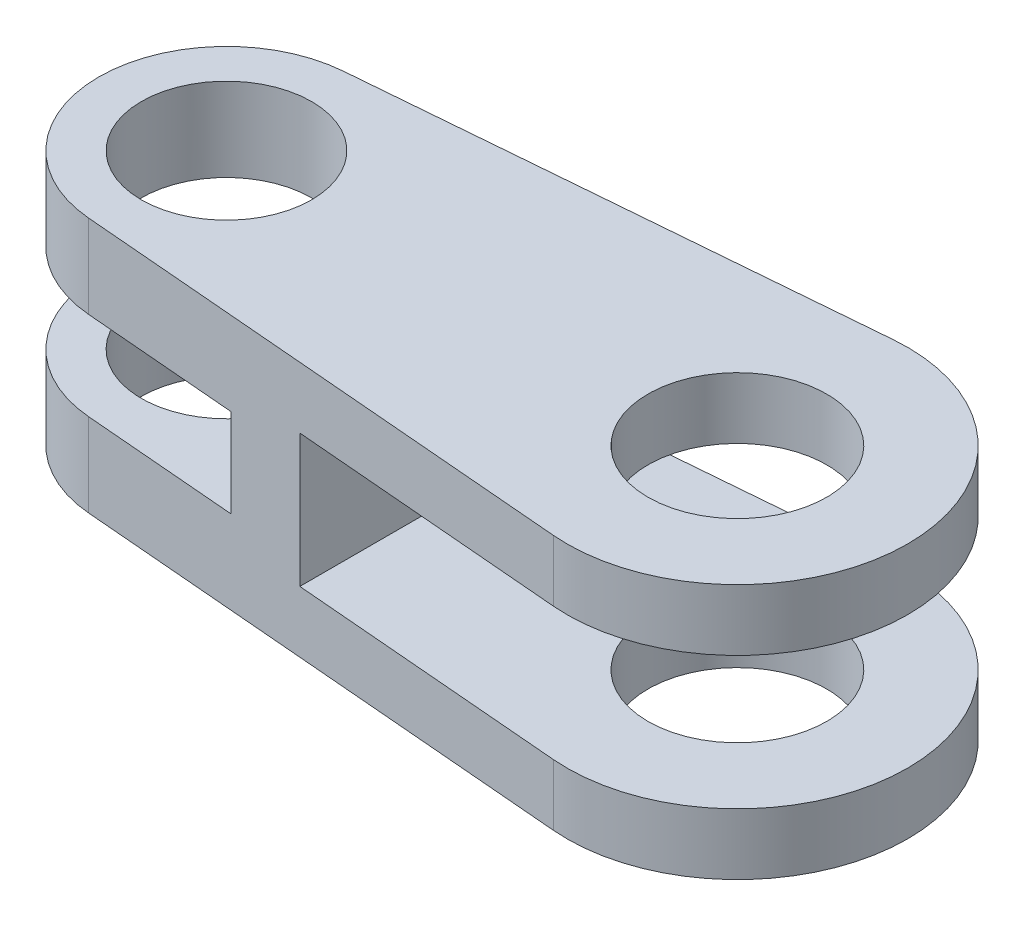
ISO-10303-21;
HEADER;
FILE_DESCRIPTION(('STEP AP214'),'2;1');
FILE_NAME('part.step','',(''),(''),'','','');
FILE_SCHEMA(('AUTOMOTIVE_DESIGN { 1 0 10303 214 1 1 1 1 }'));
ENDSEC;
DATA;
#1=APPLICATION_CONTEXT('core data for automotive mechanical design processes');
#2=APPLICATION_PROTOCOL_DEFINITION('international standard','automotive_design',2000,#1);
#3=PRODUCT_CONTEXT('',#1,'mechanical');
#4=PRODUCT('Part','Part','',(#3));
#5=PRODUCT_RELATED_PRODUCT_CATEGORY('part','',(#4));
#6=PRODUCT_DEFINITION_FORMATION('','',#4);
#7=PRODUCT_DEFINITION_CONTEXT('part definition',#1,'design');
#8=PRODUCT_DEFINITION('design','',#6,#7);
#9=PRODUCT_DEFINITION_SHAPE('','',#8);
#10=(LENGTH_UNIT() NAMED_UNIT(*) SI_UNIT(.MILLI.,.METRE.));
#11=(NAMED_UNIT(*) PLANE_ANGLE_UNIT() SI_UNIT($,.RADIAN.));
#12=(NAMED_UNIT(*) SI_UNIT($,.STERADIAN.) SOLID_ANGLE_UNIT());
#13=UNCERTAINTY_MEASURE_WITH_UNIT(LENGTH_MEASURE(1.E-05),#10,'distance_accuracy_value','');
#14=(GEOMETRIC_REPRESENTATION_CONTEXT(3) GLOBAL_UNCERTAINTY_ASSIGNED_CONTEXT((#13)) GLOBAL_UNIT_ASSIGNED_CONTEXT((#10,
#11,#12)) REPRESENTATION_CONTEXT('',''));
#15=CARTESIAN_POINT('',(0.,0.,0.));
#16=DIRECTION('',(0.,0.,1.));
#17=DIRECTION('',(1.,0.,0.));
#18=AXIS2_PLACEMENT_3D('',#15,#16,#17);
#19=CARTESIAN_POINT('',(37.0416666666667,9.525,12.6558259531156));
#20=DIRECTION('',(0.0833333333333333,0.,-0.996521728591783));
#21=DIRECTION('',(-0.996521728591783,0.,-0.0833333333333333));
#22=AXIS2_PLACEMENT_3D('',#19,#20,#21);
#23=PLANE('',#22);
#24=DIRECTION('',(0.996521728591783,0.,0.0833333333333333));
#25=VECTOR('',#24,1.);
#26=CARTESIAN_POINT('',(37.0416666666667,-4.953,12.6558259531156));
#27=LINE('',#26,#25);
#28=CARTESIAN_POINT('',(16.4,-4.953,10.9296830707927));
#29=VERTEX_POINT('',#28);
#30=CARTESIAN_POINT('',(37.0416666666667,-4.953,12.6558259531156));
#31=VERTEX_POINT('',#30);
#32=EDGE_CURVE('E131',#29,#31,#27,.T.);
#33=ORIENTED_EDGE('',*,*,#32,.F.);
#34=DIRECTION('',(0.,1.,0.));
#35=VECTOR('',#34,1.);
#36=CARTESIAN_POINT('',(16.4,-4.953,10.9296830707927));
#37=LINE('',#36,#35);
#38=CARTESIAN_POINT('',(16.4,4.953,10.9296830707927));
#39=VERTEX_POINT('',#38);
#40=EDGE_CURVE('E174',#29,#39,#37,.T.);
#41=ORIENTED_EDGE('',*,*,#40,.T.);
#42=DIRECTION('',(0.996521728591783,0.,0.0833333333333333));
#43=VECTOR('',#42,1.);
#44=CARTESIAN_POINT('',(37.0416666666667,4.953,12.6558259531156));
#45=LINE('',#44,#43);
#46=CARTESIAN_POINT('',(37.0416666666667,4.953,12.6558259531156));
#47=VERTEX_POINT('',#46);
#48=EDGE_CURVE('E135',#39,#47,#45,.T.);
#49=ORIENTED_EDGE('',*,*,#48,.T.);
#50=DIRECTION('',(0.,-1.,0.));
#51=VECTOR('',#50,1.);
#52=CARTESIAN_POINT('',(37.0416666666667,9.525,12.6558259531156));
#53=LINE('',#52,#51);
#54=CARTESIAN_POINT('',(37.0416666666667,9.525,12.6558259531156));
#55=VERTEX_POINT('',#54);
#56=EDGE_CURVE('E160',#55,#47,#53,.T.);
#57=ORIENTED_EDGE('',*,*,#56,.F.);
#58=DIRECTION('',(0.996521728591783,0.,0.0833333333333333));
#59=VECTOR('',#58,1.);
#60=CARTESIAN_POINT('',(37.0416666666667,9.525,12.6558259531156));
#61=LINE('',#60,#59);
#62=CARTESIAN_POINT('',(-0.793749999999999,9.525,9.49186946483673));
#63=VERTEX_POINT('',#62);
#64=EDGE_CURVE('E223',#63,#55,#61,.T.);
#65=ORIENTED_EDGE('',*,*,#64,.F.);
#66=DIRECTION('',(0.,-1.,0.));
#67=VECTOR('',#66,1.);
#68=CARTESIAN_POINT('',(-0.793749999999999,9.525,9.49186946483673));
#69=LINE('',#68,#67);
#70=CARTESIAN_POINT('',(-0.793749999999999,3.302,9.49186946483673));
#71=VERTEX_POINT('',#70);
#72=EDGE_CURVE('E11',#63,#71,#69,.T.);
#73=ORIENTED_EDGE('',*,*,#72,.T.);
#74=DIRECTION('',(-0.996521728591783,0.,-0.0833333333333333));
#75=VECTOR('',#74,1.);
#76=CARTESIAN_POINT('',(37.0416666666667,3.302,12.6558259531156));
#77=LINE('',#76,#75);
#78=CARTESIAN_POINT('',(10.795,3.302,10.4609694241837));
#79=VERTEX_POINT('',#78);
#80=EDGE_CURVE('E171',#79,#71,#77,.T.);
#81=ORIENTED_EDGE('',*,*,#80,.F.);
#82=DIRECTION('',(0.,1.,0.));
#83=VECTOR('',#82,1.);
#84=CARTESIAN_POINT('',(10.795,-3.302,10.4609694241837));
#85=LINE('',#84,#83);
#86=CARTESIAN_POINT('',(10.795,-3.302,10.4609694241837));
#87=VERTEX_POINT('',#86);
#88=EDGE_CURVE('E167',#87,#79,#85,.T.);
#89=ORIENTED_EDGE('',*,*,#88,.F.);
#90=DIRECTION('',(-0.996521728591783,0.,-0.0833333333333333));
#91=VECTOR('',#90,1.);
#92=CARTESIAN_POINT('',(37.0416666666667,-3.302,12.6558259531156));
#93=LINE('',#92,#91);
#94=CARTESIAN_POINT('',(-0.793749999999999,-3.302,9.49186946483673));
#95=VERTEX_POINT('',#94);
#96=EDGE_CURVE('E204',#87,#95,#93,.T.);
#97=ORIENTED_EDGE('',*,*,#96,.T.);
#98=CARTESIAN_POINT('',(-0.793749999999999,-9.525,9.49186946483673));
#99=VERTEX_POINT('',#98);
#100=EDGE_CURVE('E42',#95,#99,#69,.T.);
#101=ORIENTED_EDGE('',*,*,#100,.T.);
#102=DIRECTION('',(0.996521728591783,0.,0.0833333333333333));
#103=VECTOR('',#102,1.);
#104=CARTESIAN_POINT('',(37.0416666666667,-9.525,12.6558259531156));
#105=LINE('',#104,#103);
#106=CARTESIAN_POINT('',(37.0416666666667,-9.525,12.6558259531156));
#107=VERTEX_POINT('',#106);
#108=EDGE_CURVE('E232',#99,#107,#105,.T.);
#109=ORIENTED_EDGE('',*,*,#108,.T.);
#110=EDGE_CURVE('E154',#31,#107,#53,.T.);
#111=ORIENTED_EDGE('',*,*,#110,.F.);
#112=EDGE_LOOP('',(#33,#41,#49,#57,#65,#73,#81,#89,#97,#101,#109,#111));
#113=FACE_BOUND('',#112,.T.);
#114=ADVANCED_FACE('F33',(#113),#23,.F.);
#115=CARTESIAN_POINT('',(38.1,9.525,0.));
#116=DIRECTION('',(0.,-1.,0.));
#117=DIRECTION('',(0.,0.,-1.));
#118=AXIS2_PLACEMENT_3D('',#115,#116,#117);
#119=CYLINDRICAL_SURFACE('',#118,12.7);
#120=CARTESIAN_POINT('',(38.1,-4.953,0.));
#121=DIRECTION('',(0.,1.,0.));
#122=DIRECTION('',(0.,0.,1.));
#123=AXIS2_PLACEMENT_3D('',#120,#121,#122);
#124=CIRCLE('',#123,12.7);
#125=CARTESIAN_POINT('',(37.0416666666667,-4.953,-12.6558259531156));
#126=VERTEX_POINT('',#125);
#127=EDGE_CURVE('E124',#31,#126,#124,.T.);
#128=ORIENTED_EDGE('',*,*,#127,.F.);
#129=ORIENTED_EDGE('',*,*,#110,.T.);
#130=CARTESIAN_POINT('',(38.1,-9.525,0.));
#131=DIRECTION('',(0.,1.,0.));
#132=DIRECTION('',(0.,0.,-1.));
#133=AXIS2_PLACEMENT_3D('',#130,#131,#132);
#134=CIRCLE('',#133,12.7);
#135=CARTESIAN_POINT('',(37.0416666666667,-9.525,-12.6558259531156));
#136=VERTEX_POINT('',#135);
#137=EDGE_CURVE('E148',#107,#136,#134,.T.);
#138=ORIENTED_EDGE('',*,*,#137,.T.);
#139=DIRECTION('',(0.,-1.,0.));
#140=VECTOR('',#139,1.);
#141=CARTESIAN_POINT('',(37.0416666666667,9.525,-12.6558259531156));
#142=LINE('',#141,#140);
#143=EDGE_CURVE('E140',#126,#136,#142,.T.);
#144=ORIENTED_EDGE('',*,*,#143,.F.);
#145=EDGE_LOOP('',(#128,#129,#138,#144));
#146=FACE_BOUND('',#145,.T.);
#147=ADVANCED_FACE('F146',(#146),#119,.T.);
#148=CARTESIAN_POINT('',(-0.79375,9.525,-9.49186946483673));
#149=DIRECTION('',(0.0833333333333332,0.,0.996521728591783));
#150=DIRECTION('',(0.996521728591783,0.,-0.0833333333333332));
#151=AXIS2_PLACEMENT_3D('',#148,#149,#150);
#152=PLANE('',#151);
#153=DIRECTION('',(-0.996521728591783,0.,0.0833333333333333));
#154=VECTOR('',#153,1.);
#155=CARTESIAN_POINT('',(37.0416666666667,-4.953,-12.6558259531156));
#156=LINE('',#155,#154);
#157=CARTESIAN_POINT('',(16.4,-4.953,-10.9296830707927));
#158=VERTEX_POINT('',#157);
#159=EDGE_CURVE('E128',#126,#158,#156,.T.);
#160=ORIENTED_EDGE('',*,*,#159,.F.);
#161=ORIENTED_EDGE('',*,*,#143,.T.);
#162=DIRECTION('',(-0.996521728591783,0.,0.0833333333333332));
#163=VECTOR('',#162,1.);
#164=CARTESIAN_POINT('',(-0.79375,-9.525,-9.49186946483673));
#165=LINE('',#164,#163);
#166=CARTESIAN_POINT('',(-0.79375,-9.525,-9.49186946483673));
#167=VERTEX_POINT('',#166);
#168=EDGE_CURVE('E224',#136,#167,#165,.T.);
#169=ORIENTED_EDGE('',*,*,#168,.T.);
#170=DIRECTION('',(0.,-1.,0.));
#171=VECTOR('',#170,1.);
#172=CARTESIAN_POINT('',(-0.79375,9.525,-9.49186946483673));
#173=LINE('',#172,#171);
#174=CARTESIAN_POINT('',(-0.79375,-3.302,-9.49186946483673));
#175=VERTEX_POINT('',#174);
#176=EDGE_CURVE('E156',#175,#167,#173,.T.);
#177=ORIENTED_EDGE('',*,*,#176,.F.);
#178=DIRECTION('',(0.996521728591783,0.,-0.0833333333333332));
#179=VECTOR('',#178,1.);
#180=CARTESIAN_POINT('',(-0.79375,-3.302,-9.49186946483673));
#181=LINE('',#180,#179);
#182=CARTESIAN_POINT('',(10.795,-3.302,-10.4609694241837));
#183=VERTEX_POINT('',#182);
#184=EDGE_CURVE('E170',#175,#183,#181,.T.);
#185=ORIENTED_EDGE('',*,*,#184,.T.);
#186=DIRECTION('',(0.,1.,0.));
#187=VECTOR('',#186,1.);
#188=CARTESIAN_POINT('',(10.795,-3.302,-10.4609694241837));
#189=LINE('',#188,#187);
#190=CARTESIAN_POINT('',(10.795,3.302,-10.4609694241837));
#191=VERTEX_POINT('',#190);
#192=EDGE_CURVE('E190',#183,#191,#189,.T.);
#193=ORIENTED_EDGE('',*,*,#192,.T.);
#194=DIRECTION('',(0.996521728591783,0.,-0.0833333333333332));
#195=VECTOR('',#194,1.);
#196=CARTESIAN_POINT('',(-0.79375,3.302,-9.49186946483673));
#197=LINE('',#196,#195);
#198=CARTESIAN_POINT('',(-0.79375,3.302,-9.49186946483673));
#199=VERTEX_POINT('',#198);
#200=EDGE_CURVE('E166',#199,#191,#197,.T.);
#201=ORIENTED_EDGE('',*,*,#200,.F.);
#202=CARTESIAN_POINT('',(-0.79375,9.525,-9.49186946483673));
#203=VERTEX_POINT('',#202);
#204=EDGE_CURVE('E151',#203,#199,#173,.T.);
#205=ORIENTED_EDGE('',*,*,#204,.F.);
#206=DIRECTION('',(-0.996521728591783,0.,0.0833333333333332));
#207=VECTOR('',#206,1.);
#208=CARTESIAN_POINT('',(-0.79375,9.525,-9.49186946483673));
#209=LINE('',#208,#207);
#210=CARTESIAN_POINT('',(37.0416666666667,9.525,-12.6558259531156));
#211=VERTEX_POINT('',#210);
#212=EDGE_CURVE('E228',#211,#203,#209,.T.);
#213=ORIENTED_EDGE('',*,*,#212,.F.);
#214=CARTESIAN_POINT('',(37.0416666666667,4.953,-12.6558259531156));
#215=VERTEX_POINT('',#214);
#216=EDGE_CURVE('E150',#211,#215,#142,.T.);
#217=ORIENTED_EDGE('',*,*,#216,.T.);
#218=DIRECTION('',(-0.996521728591783,0.,0.0833333333333333));
#219=VECTOR('',#218,1.);
#220=CARTESIAN_POINT('',(37.0416666666667,4.953,-12.6558259531156));
#221=LINE('',#220,#219);
#222=CARTESIAN_POINT('',(16.4,4.953,-10.9296830707927));
#223=VERTEX_POINT('',#222);
#224=EDGE_CURVE('E264',#215,#223,#221,.T.);
#225=ORIENTED_EDGE('',*,*,#224,.T.);
#226=DIRECTION('',(0.,1.,0.));
#227=VECTOR('',#226,1.);
#228=CARTESIAN_POINT('',(16.4,-4.953,-10.9296830707927));
#229=LINE('',#228,#227);
#230=EDGE_CURVE('E143',#158,#223,#229,.T.);
#231=ORIENTED_EDGE('',*,*,#230,.F.);
#232=EDGE_LOOP('',(#160,#161,#169,#177,#185,#193,#201,#205,#213,#217,#225,#231));
#233=FACE_BOUND('',#232,.T.);
#234=ADVANCED_FACE('F138',(#233),#152,.F.);
#235=CARTESIAN_POINT('',(38.1,9.525,0.));
#236=DIRECTION('',(0.,-1.,0.));
#237=DIRECTION('',(0.,0.,-1.));
#238=AXIS2_PLACEMENT_3D('',#235,#236,#237);
#239=CYLINDRICAL_SURFACE('',#238,6.6675);
#240=CARTESIAN_POINT('',(38.1,-9.525,0.));
#241=DIRECTION('',(0.,1.,0.));
#242=DIRECTION('',(0.,0.,1.));
#243=AXIS2_PLACEMENT_3D('',#240,#241,#242);
#244=CIRCLE('',#243,6.6675);
#245=CARTESIAN_POINT('',(38.1,-9.525,6.6675));
#246=VERTEX_POINT('',#245);
#247=EDGE_CURVE('E211',#246,#246,#244,.T.);
#248=ORIENTED_EDGE('',*,*,#247,.F.);
#249=EDGE_LOOP('',(#248));
#250=FACE_BOUND('',#249,.T.);
#251=CARTESIAN_POINT('',(38.1,-4.953,0.));
#252=DIRECTION('',(0.,1.,0.));
#253=DIRECTION('',(0.,0.,1.));
#254=AXIS2_PLACEMENT_3D('',#251,#252,#253);
#255=CIRCLE('',#254,6.6675);
#256=CARTESIAN_POINT('',(38.1,-4.953,6.6675));
#257=VERTEX_POINT('',#256);
#258=EDGE_CURVE('E37',#257,#257,#255,.T.);
#259=ORIENTED_EDGE('',*,*,#258,.T.);
#260=EDGE_LOOP('',(#259));
#261=FACE_BOUND('',#260,.T.);
#262=ADVANCED_FACE('F294',(#250,#261),#239,.F.);
#263=CARTESIAN_POINT('',(0.,9.525,0.));
#264=DIRECTION('',(0.,-1.,0.));
#265=DIRECTION('',(0.,0.,-1.));
#266=AXIS2_PLACEMENT_3D('',#263,#264,#265);
#267=CYLINDRICAL_SURFACE('',#266,9.525);
#268=CARTESIAN_POINT('',(0.,3.302,0.));
#269=DIRECTION('',(0.,-1.,0.));
#270=DIRECTION('',(0.,0.,-1.));
#271=AXIS2_PLACEMENT_3D('',#268,#269,#270);
#272=CIRCLE('',#271,9.525);
#273=EDGE_CURVE('E58',#71,#199,#272,.T.);
#274=ORIENTED_EDGE('',*,*,#273,.F.);
#275=ORIENTED_EDGE('',*,*,#72,.F.);
#276=CARTESIAN_POINT('',(0.,9.525,0.));
#277=DIRECTION('',(0.,1.,0.));
#278=DIRECTION('',(0.,0.,-1.));
#279=AXIS2_PLACEMENT_3D('',#276,#277,#278);
#280=CIRCLE('',#279,9.525);
#281=EDGE_CURVE('E220',#203,#63,#280,.T.);
#282=ORIENTED_EDGE('',*,*,#281,.F.);
#283=ORIENTED_EDGE('',*,*,#204,.T.);
#284=EDGE_LOOP('',(#274,#275,#282,#283));
#285=FACE_BOUND('',#284,.T.);
#286=ADVANCED_FACE('F256',(#285),#267,.T.);
#287=CARTESIAN_POINT('',(0.,9.525,0.));
#288=DIRECTION('',(0.,-1.,0.));
#289=DIRECTION('',(0.,0.,-1.));
#290=AXIS2_PLACEMENT_3D('',#287,#288,#289);
#291=CYLINDRICAL_SURFACE('',#290,6.35);
#292=CARTESIAN_POINT('',(0.,9.525,0.));
#293=DIRECTION('',(0.,1.,0.));
#294=DIRECTION('',(0.,0.,1.));
#295=AXIS2_PLACEMENT_3D('',#292,#293,#294);
#296=CIRCLE('',#295,6.35);
#297=CARTESIAN_POINT('',(0.,9.525,6.35));
#298=VERTEX_POINT('',#297);
#299=EDGE_CURVE('E208',#298,#298,#296,.T.);
#300=ORIENTED_EDGE('',*,*,#299,.T.);
#301=EDGE_LOOP('',(#300));
#302=FACE_BOUND('',#301,.T.);
#303=CARTESIAN_POINT('',(0.,3.302,0.));
#304=DIRECTION('',(0.,-1.,0.));
#305=DIRECTION('',(0.,0.,-1.));
#306=AXIS2_PLACEMENT_3D('',#303,#304,#305);
#307=CIRCLE('',#306,6.35);
#308=CARTESIAN_POINT('',(0.,3.302,-6.35));
#309=VERTEX_POINT('',#308);
#310=EDGE_CURVE('E163',#309,#309,#307,.T.);
#311=ORIENTED_EDGE('',*,*,#310,.T.);
#312=EDGE_LOOP('',(#311));
#313=FACE_BOUND('',#312,.T.);
#314=ADVANCED_FACE('F300',(#302,#313),#291,.F.);
#315=CARTESIAN_POINT('',(0.,9.525,0.));
#316=DIRECTION('',(0.,-1.,0.));
#317=DIRECTION('',(0.,0.,-1.));
#318=AXIS2_PLACEMENT_3D('',#315,#316,#317);
#319=PLANE('',#318);
#320=ORIENTED_EDGE('',*,*,#281,.T.);
#321=ORIENTED_EDGE('',*,*,#64,.T.);
#322=CARTESIAN_POINT('',(38.1,9.525,0.));
#323=DIRECTION('',(0.,1.,0.));
#324=DIRECTION('',(0.,0.,-1.));
#325=AXIS2_PLACEMENT_3D('',#322,#323,#324);
#326=CIRCLE('',#325,12.7);
#327=EDGE_CURVE('E226',#55,#211,#326,.T.);
#328=ORIENTED_EDGE('',*,*,#327,.T.);
#329=ORIENTED_EDGE('',*,*,#212,.T.);
#330=EDGE_LOOP('',(#320,#321,#328,#329));
#331=FACE_BOUND('',#330,.T.);
#332=CARTESIAN_POINT('',(38.1,9.525,0.));
#333=DIRECTION('',(0.,1.,0.));
#334=DIRECTION('',(0.,0.,1.));
#335=AXIS2_PLACEMENT_3D('',#332,#333,#334);
#336=CIRCLE('',#335,6.6675);
#337=CARTESIAN_POINT('',(38.1,9.525,6.6675));
#338=VERTEX_POINT('',#337);
#339=EDGE_CURVE('E214',#338,#338,#336,.T.);
#340=ORIENTED_EDGE('',*,*,#339,.F.);
#341=EDGE_LOOP('',(#340));
#342=FACE_BOUND('',#341,.T.);
#343=ORIENTED_EDGE('',*,*,#299,.F.);
#344=EDGE_LOOP('',(#343));
#345=FACE_BOUND('',#344,.T.);
#346=ADVANCED_FACE('F259',(#331,#342,#345),#319,.F.);
#347=CARTESIAN_POINT('',(0.,-9.525,0.));
#348=DIRECTION('',(0.,-1.,0.));
#349=DIRECTION('',(0.,0.,-1.));
#350=AXIS2_PLACEMENT_3D('',#347,#348,#349);
#351=PLANE('',#350);
#352=ORIENTED_EDGE('',*,*,#247,.T.);
#353=EDGE_LOOP('',(#352));
#354=FACE_BOUND('',#353,.T.);
#355=CARTESIAN_POINT('',(0.,-9.525,0.));
#356=DIRECTION('',(0.,1.,0.));
#357=DIRECTION('',(0.,0.,-1.));
#358=AXIS2_PLACEMENT_3D('',#355,#356,#357);
#359=CIRCLE('',#358,9.525);
#360=EDGE_CURVE('E217',#167,#99,#359,.T.);
#361=ORIENTED_EDGE('',*,*,#360,.F.);
#362=ORIENTED_EDGE('',*,*,#168,.F.);
#363=ORIENTED_EDGE('',*,*,#137,.F.);
#364=ORIENTED_EDGE('',*,*,#108,.F.);
#365=EDGE_LOOP('',(#361,#362,#363,#364));
#366=FACE_BOUND('',#365,.T.);
#367=CARTESIAN_POINT('',(0.,-9.525,0.));
#368=DIRECTION('',(0.,1.,0.));
#369=DIRECTION('',(0.,0.,1.));
#370=AXIS2_PLACEMENT_3D('',#367,#368,#369);
#371=CIRCLE('',#370,6.35);
#372=CARTESIAN_POINT('',(0.,-9.525,6.35));
#373=VERTEX_POINT('',#372);
#374=EDGE_CURVE('E207',#373,#373,#371,.T.);
#375=ORIENTED_EDGE('',*,*,#374,.T.);
#376=EDGE_LOOP('',(#375));
#377=FACE_BOUND('',#376,.T.);
#378=ADVANCED_FACE('F239',(#354,#366,#377),#351,.T.);
#379=ORIENTED_EDGE('',*,*,#100,.F.);
#380=CARTESIAN_POINT('',(0.,-3.302,0.));
#381=DIRECTION('',(0.,-1.,0.));
#382=DIRECTION('',(0.,0.,-1.));
#383=AXIS2_PLACEMENT_3D('',#380,#381,#382);
#384=CIRCLE('',#383,9.525);
#385=EDGE_CURVE('E201',#95,#175,#384,.T.);
#386=ORIENTED_EDGE('',*,*,#385,.T.);
#387=ORIENTED_EDGE('',*,*,#176,.T.);
#388=ORIENTED_EDGE('',*,*,#360,.T.);
#389=EDGE_LOOP('',(#379,#386,#387,#388));
#390=FACE_BOUND('',#389,.T.);
#391=ADVANCED_FACE('F35',(#390),#267,.T.);
#392=ORIENTED_EDGE('',*,*,#56,.T.);
#393=CARTESIAN_POINT('',(38.1,4.953,0.));
#394=DIRECTION('',(0.,1.,0.));
#395=DIRECTION('',(0.,0.,1.));
#396=AXIS2_PLACEMENT_3D('',#393,#394,#395);
#397=CIRCLE('',#396,12.7);
#398=EDGE_CURVE('E268',#47,#215,#397,.T.);
#399=ORIENTED_EDGE('',*,*,#398,.T.);
#400=ORIENTED_EDGE('',*,*,#216,.F.);
#401=ORIENTED_EDGE('',*,*,#327,.F.);
#402=EDGE_LOOP('',(#392,#399,#400,#401));
#403=FACE_BOUND('',#402,.T.);
#404=ADVANCED_FACE('F267',(#403),#119,.T.);
#405=CARTESIAN_POINT('',(38.1,4.953,0.));
#406=DIRECTION('',(0.,1.,0.));
#407=DIRECTION('',(0.,0.,1.));
#408=AXIS2_PLACEMENT_3D('',#405,#406,#407);
#409=CIRCLE('',#408,6.6675);
#410=CARTESIAN_POINT('',(38.1,4.953,6.6675));
#411=VERTEX_POINT('',#410);
#412=EDGE_CURVE('E172',#411,#411,#409,.T.);
#413=ORIENTED_EDGE('',*,*,#412,.F.);
#414=EDGE_LOOP('',(#413));
#415=FACE_BOUND('',#414,.T.);
#416=ORIENTED_EDGE('',*,*,#339,.T.);
#417=EDGE_LOOP('',(#416));
#418=FACE_BOUND('',#417,.T.);
#419=ADVANCED_FACE('F291',(#415,#418),#239,.F.);
#420=CARTESIAN_POINT('',(0.,-3.302,0.));
#421=DIRECTION('',(0.,-1.,0.));
#422=DIRECTION('',(0.,0.,-1.));
#423=AXIS2_PLACEMENT_3D('',#420,#421,#422);
#424=CIRCLE('',#423,6.35);
#425=CARTESIAN_POINT('',(0.,-3.302,-6.35));
#426=VERTEX_POINT('',#425);
#427=EDGE_CURVE('E168',#426,#426,#424,.T.);
#428=ORIENTED_EDGE('',*,*,#427,.F.);
#429=EDGE_LOOP('',(#428));
#430=FACE_BOUND('',#429,.T.);
#431=ORIENTED_EDGE('',*,*,#374,.F.);
#432=EDGE_LOOP('',(#431));
#433=FACE_BOUND('',#432,.T.);
#434=ADVANCED_FACE('F303',(#430,#433),#291,.F.);
#435=CARTESIAN_POINT('',(0.,-3.302,0.));
#436=DIRECTION('',(0.,-1.,0.));
#437=DIRECTION('',(0.,0.,-1.));
#438=AXIS2_PLACEMENT_3D('',#435,#436,#437);
#439=PLANE('',#438);
#440=ORIENTED_EDGE('',*,*,#427,.T.);
#441=EDGE_LOOP('',(#440));
#442=FACE_BOUND('',#441,.T.);
#443=DIRECTION('',(0.,0.,-1.));
#444=VECTOR('',#443,1.);
#445=CARTESIAN_POINT('',(10.795,-3.302,10.4609694241837));
#446=LINE('',#445,#444);
#447=EDGE_CURVE('E187',#87,#183,#446,.T.);
#448=ORIENTED_EDGE('',*,*,#447,.T.);
#449=ORIENTED_EDGE('',*,*,#184,.F.);
#450=ORIENTED_EDGE('',*,*,#385,.F.);
#451=ORIENTED_EDGE('',*,*,#96,.F.);
#452=EDGE_LOOP('',(#448,#449,#450,#451));
#453=FACE_BOUND('',#452,.T.);
#454=ADVANCED_FACE('F244',(#442,#453),#439,.F.);
#455=CARTESIAN_POINT('',(0.,3.302,0.));
#456=DIRECTION('',(0.,-1.,0.));
#457=DIRECTION('',(0.,0.,-1.));
#458=AXIS2_PLACEMENT_3D('',#455,#456,#457);
#459=PLANE('',#458);
#460=ORIENTED_EDGE('',*,*,#310,.F.);
#461=EDGE_LOOP('',(#460));
#462=FACE_BOUND('',#461,.T.);
#463=ORIENTED_EDGE('',*,*,#80,.T.);
#464=ORIENTED_EDGE('',*,*,#273,.T.);
#465=ORIENTED_EDGE('',*,*,#200,.T.);
#466=DIRECTION('',(0.,0.,-1.));
#467=VECTOR('',#466,1.);
#468=CARTESIAN_POINT('',(10.795,3.302,10.4609694241837));
#469=LINE('',#468,#467);
#470=EDGE_CURVE('E178',#79,#191,#469,.T.);
#471=ORIENTED_EDGE('',*,*,#470,.F.);
#472=EDGE_LOOP('',(#463,#464,#465,#471));
#473=FACE_BOUND('',#472,.T.);
#474=ADVANCED_FACE('F251',(#462,#473),#459,.T.);
#475=CARTESIAN_POINT('',(10.795,-3.302,10.4609694241837));
#476=DIRECTION('',(1.,0.,0.));
#477=DIRECTION('',(0.,0.,-1.));
#478=AXIS2_PLACEMENT_3D('',#475,#476,#477);
#479=PLANE('',#478);
#480=ORIENTED_EDGE('',*,*,#470,.T.);
#481=ORIENTED_EDGE('',*,*,#192,.F.);
#482=ORIENTED_EDGE('',*,*,#447,.F.);
#483=ORIENTED_EDGE('',*,*,#88,.T.);
#484=EDGE_LOOP('',(#480,#481,#482,#483));
#485=FACE_BOUND('',#484,.T.);
#486=ADVANCED_FACE('F250',(#485),#479,.F.);
#487=CARTESIAN_POINT('',(16.4,-4.953,-10.9296830707927));
#488=DIRECTION('',(-1.,0.,0.));
#489=DIRECTION('',(0.,0.,1.));
#490=AXIS2_PLACEMENT_3D('',#487,#488,#489);
#491=PLANE('',#490);
#492=DIRECTION('',(0.,0.,1.));
#493=VECTOR('',#492,1.);
#494=CARTESIAN_POINT('',(16.4,4.953,-10.9296830707927));
#495=LINE('',#494,#493);
#496=EDGE_CURVE('E50',#223,#39,#495,.T.);
#497=ORIENTED_EDGE('',*,*,#496,.T.);
#498=ORIENTED_EDGE('',*,*,#40,.F.);
#499=DIRECTION('',(0.,0.,1.));
#500=VECTOR('',#499,1.);
#501=CARTESIAN_POINT('',(16.4,-4.953,-10.9296830707927));
#502=LINE('',#501,#500);
#503=EDGE_CURVE('E144',#158,#29,#502,.T.);
#504=ORIENTED_EDGE('',*,*,#503,.F.);
#505=ORIENTED_EDGE('',*,*,#230,.T.);
#506=EDGE_LOOP('',(#497,#498,#504,#505));
#507=FACE_BOUND('',#506,.T.);
#508=ADVANCED_FACE('F280',(#507),#491,.F.);
#509=CARTESIAN_POINT('',(38.1,-4.953,0.));
#510=DIRECTION('',(0.,1.,0.));
#511=DIRECTION('',(0.,0.,1.));
#512=AXIS2_PLACEMENT_3D('',#509,#510,#511);
#513=PLANE('',#512);
#514=ORIENTED_EDGE('',*,*,#258,.F.);
#515=EDGE_LOOP('',(#514));
#516=FACE_BOUND('',#515,.T.);
#517=ORIENTED_EDGE('',*,*,#127,.T.);
#518=ORIENTED_EDGE('',*,*,#159,.T.);
#519=ORIENTED_EDGE('',*,*,#503,.T.);
#520=ORIENTED_EDGE('',*,*,#32,.T.);
#521=EDGE_LOOP('',(#517,#518,#519,#520));
#522=FACE_BOUND('',#521,.T.);
#523=ADVANCED_FACE('F126',(#516,#522),#513,.T.);
#524=CARTESIAN_POINT('',(38.1,4.953,0.));
#525=DIRECTION('',(0.,1.,0.));
#526=DIRECTION('',(0.,0.,1.));
#527=AXIS2_PLACEMENT_3D('',#524,#525,#526);
#528=PLANE('',#527);
#529=ORIENTED_EDGE('',*,*,#412,.T.);
#530=EDGE_LOOP('',(#529));
#531=FACE_BOUND('',#530,.T.);
#532=ORIENTED_EDGE('',*,*,#398,.F.);
#533=ORIENTED_EDGE('',*,*,#48,.F.);
#534=ORIENTED_EDGE('',*,*,#496,.F.);
#535=ORIENTED_EDGE('',*,*,#224,.F.);
#536=EDGE_LOOP('',(#532,#533,#534,#535));
#537=FACE_BOUND('',#536,.T.);
#538=ADVANCED_FACE('F274',(#531,#537),#528,.F.);
#539=CLOSED_SHELL('',(#114,#147,#234,#262,#286,#314,#346,#378,#391,#404,#419,#434,#454,#474,
#486,#508,#523,#538));
#540=MANIFOLD_SOLID_BREP('B2',#539);
#541=ADVANCED_BREP_SHAPE_REPRESENTATION('',(#18,#540),#14);
#542=SHAPE_DEFINITION_REPRESENTATION(#9,#541);
ENDSEC;
END-ISO-10303-21;
